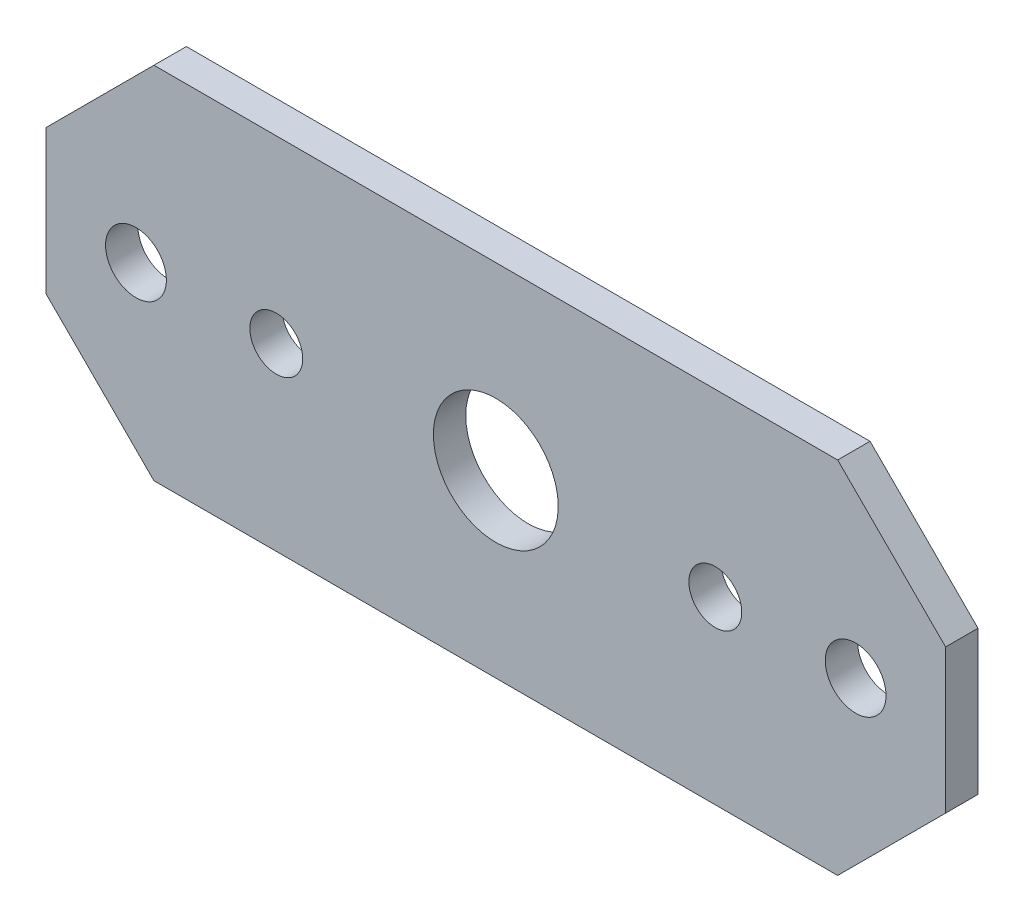
ISO-10303-21;
HEADER;
FILE_DESCRIPTION(('STEP AP214'),'2;1');
FILE_NAME('part.step','',(''),(''),'','','');
FILE_SCHEMA(('AUTOMOTIVE_DESIGN { 1 0 10303 214 1 1 1 1 }'));
ENDSEC;
DATA;
#1=APPLICATION_CONTEXT('core data for automotive mechanical design processes');
#2=APPLICATION_PROTOCOL_DEFINITION('international standard','automotive_design',2000,#1);
#3=PRODUCT_CONTEXT('',#1,'mechanical');
#4=PRODUCT('Part','Part','',(#3));
#5=PRODUCT_RELATED_PRODUCT_CATEGORY('part','',(#4));
#6=PRODUCT_DEFINITION_FORMATION('','',#4);
#7=PRODUCT_DEFINITION_CONTEXT('part definition',#1,'design');
#8=PRODUCT_DEFINITION('design','',#6,#7);
#9=PRODUCT_DEFINITION_SHAPE('','',#8);
#10=(LENGTH_UNIT() NAMED_UNIT(*) SI_UNIT(.MILLI.,.METRE.));
#11=(NAMED_UNIT(*) PLANE_ANGLE_UNIT() SI_UNIT($,.RADIAN.));
#12=(NAMED_UNIT(*) SI_UNIT($,.STERADIAN.) SOLID_ANGLE_UNIT());
#13=UNCERTAINTY_MEASURE_WITH_UNIT(LENGTH_MEASURE(1.E-05),#10,'distance_accuracy_value','');
#14=(GEOMETRIC_REPRESENTATION_CONTEXT(3) GLOBAL_UNCERTAINTY_ASSIGNED_CONTEXT((#13)) GLOBAL_UNIT_ASSIGNED_CONTEXT((#10,
#11,#12)) REPRESENTATION_CONTEXT('',''));
#15=CARTESIAN_POINT('',(0.,0.,0.));
#16=DIRECTION('',(0.,0.,1.));
#17=DIRECTION('',(1.,0.,0.));
#18=AXIS2_PLACEMENT_3D('',#15,#16,#17);
#19=CARTESIAN_POINT('',(-31.75,12.7,2.286));
#20=DIRECTION('',(0.,0.,1.));
#21=DIRECTION('',(1.,0.,0.));
#22=AXIS2_PLACEMENT_3D('',#19,#20,#21);
#23=PLANE('',#22);
#24=DIRECTION('',(1.,0.,0.));
#25=VECTOR('',#24,1.);
#26=CARTESIAN_POINT('',(-31.75,12.7,2.286));
#27=LINE('',#26,#25);
#28=CARTESIAN_POINT('',(24.13,12.7,2.286));
#29=VERTEX_POINT('',#28);
#30=CARTESIAN_POINT('',(-24.13,12.7,2.286));
#31=VERTEX_POINT('',#30);
#32=EDGE_CURVE('E342',#29,#31,#27,.F.);
#33=ORIENTED_EDGE('',*,*,#32,.T.);
#34=DIRECTION('',(0.707106781186547,0.707106781186548,0.));
#35=VECTOR('',#34,1.);
#36=CARTESIAN_POINT('',(-31.75,5.08,2.286));
#37=LINE('',#36,#35);
#38=CARTESIAN_POINT('',(-31.75,5.08,2.286));
#39=VERTEX_POINT('',#38);
#40=EDGE_CURVE('E337',#31,#39,#37,.F.);
#41=ORIENTED_EDGE('',*,*,#40,.T.);
#42=DIRECTION('',(0.,1.,0.));
#43=VECTOR('',#42,1.);
#44=CARTESIAN_POINT('',(-31.75,12.7,2.286));
#45=LINE('',#44,#43);
#46=CARTESIAN_POINT('',(-31.75,-5.08,2.286));
#47=VERTEX_POINT('',#46);
#48=EDGE_CURVE('E332',#39,#47,#45,.F.);
#49=ORIENTED_EDGE('',*,*,#48,.T.);
#50=DIRECTION('',(-0.707106781186547,0.707106781186548,0.));
#51=VECTOR('',#50,1.);
#52=CARTESIAN_POINT('',(-24.13,-12.7,2.286));
#53=LINE('',#52,#51);
#54=CARTESIAN_POINT('',(-24.13,-12.7,2.286));
#55=VERTEX_POINT('',#54);
#56=EDGE_CURVE('E327',#47,#55,#53,.F.);
#57=ORIENTED_EDGE('',*,*,#56,.T.);
#58=DIRECTION('',(-1.,0.,0.));
#59=VECTOR('',#58,1.);
#60=CARTESIAN_POINT('',(-31.75,-12.7,2.286));
#61=LINE('',#60,#59);
#62=CARTESIAN_POINT('',(24.13,-12.7,2.286));
#63=VERTEX_POINT('',#62);
#64=EDGE_CURVE('E83',#55,#63,#61,.F.);
#65=ORIENTED_EDGE('',*,*,#64,.T.);
#66=DIRECTION('',(-0.707106781186548,-0.707106781186547,0.));
#67=VECTOR('',#66,1.);
#68=CARTESIAN_POINT('',(31.75,-5.07999999999999,2.286));
#69=LINE('',#68,#67);
#70=CARTESIAN_POINT('',(31.75,-5.07999999999999,2.286));
#71=VERTEX_POINT('',#70);
#72=EDGE_CURVE('E81',#63,#71,#69,.F.);
#73=ORIENTED_EDGE('',*,*,#72,.T.);
#74=DIRECTION('',(0.,1.,0.));
#75=VECTOR('',#74,1.);
#76=CARTESIAN_POINT('',(31.75,12.7,2.286));
#77=LINE('',#76,#75);
#78=CARTESIAN_POINT('',(31.75,5.07999999999999,2.286));
#79=VERTEX_POINT('',#78);
#80=EDGE_CURVE('E78',#71,#79,#77,.T.);
#81=ORIENTED_EDGE('',*,*,#80,.T.);
#82=DIRECTION('',(0.707106781186548,-0.707106781186547,0.));
#83=VECTOR('',#82,1.);
#84=CARTESIAN_POINT('',(24.13,12.7,2.286));
#85=LINE('',#84,#83);
#86=EDGE_CURVE('E312',#79,#29,#85,.F.);
#87=ORIENTED_EDGE('',*,*,#86,.T.);
#88=EDGE_LOOP('',(#33,#41,#49,#57,#65,#73,#81,#87));
#89=FACE_BOUND('',#88,.T.);
#90=CARTESIAN_POINT('',(0.,0.,2.286));
#91=DIRECTION('',(0.,0.,-1.));
#92=DIRECTION('',(-1.,0.,0.));
#93=AXIS2_PLACEMENT_3D('',#90,#91,#92);
#94=CIRCLE('',#93,4.4069);
#95=CARTESIAN_POINT('',(-4.4069,0.,2.286));
#96=VERTEX_POINT('',#95);
#97=EDGE_CURVE('E89',#96,#96,#94,.T.);
#98=ORIENTED_EDGE('',*,*,#97,.T.);
#99=EDGE_LOOP('',(#98));
#100=FACE_BOUND('',#99,.T.);
#101=CARTESIAN_POINT('',(25.4,0.,2.286));
#102=DIRECTION('',(0.,0.,-1.));
#103=DIRECTION('',(-1.,0.,0.));
#104=AXIS2_PLACEMENT_3D('',#101,#102,#103);
#105=CIRCLE('',#104,2.1463);
#106=CARTESIAN_POINT('',(23.2537,0.,2.286));
#107=VERTEX_POINT('',#106);
#108=EDGE_CURVE('E121',#107,#107,#105,.T.);
#109=ORIENTED_EDGE('',*,*,#108,.T.);
#110=EDGE_LOOP('',(#109));
#111=FACE_BOUND('',#110,.T.);
#112=CARTESIAN_POINT('',(-25.4,0.,2.286));
#113=DIRECTION('',(0.,0.,-1.));
#114=DIRECTION('',(-1.,0.,0.));
#115=AXIS2_PLACEMENT_3D('',#112,#113,#114);
#116=CIRCLE('',#115,2.1463);
#117=CARTESIAN_POINT('',(-27.5463,0.,2.286));
#118=VERTEX_POINT('',#117);
#119=EDGE_CURVE('E124',#118,#118,#116,.T.);
#120=ORIENTED_EDGE('',*,*,#119,.T.);
#121=EDGE_LOOP('',(#120));
#122=FACE_BOUND('',#121,.T.);
#123=CARTESIAN_POINT('',(15.494,0.,2.286));
#124=DIRECTION('',(0.,0.,-1.));
#125=DIRECTION('',(-1.,0.,0.));
#126=AXIS2_PLACEMENT_3D('',#123,#124,#125);
#127=CIRCLE('',#126,1.8669);
#128=CARTESIAN_POINT('',(13.6271,0.,2.286));
#129=VERTEX_POINT('',#128);
#130=EDGE_CURVE('E126',#129,#129,#127,.T.);
#131=ORIENTED_EDGE('',*,*,#130,.T.);
#132=EDGE_LOOP('',(#131));
#133=FACE_BOUND('',#132,.T.);
#134=CARTESIAN_POINT('',(-15.494,0.,2.286));
#135=DIRECTION('',(0.,0.,-1.));
#136=DIRECTION('',(-1.,0.,0.));
#137=AXIS2_PLACEMENT_3D('',#134,#135,#136);
#138=CIRCLE('',#137,1.8669);
#139=CARTESIAN_POINT('',(-17.3609,0.,2.286));
#140=VERTEX_POINT('',#139);
#141=EDGE_CURVE('E19',#140,#140,#138,.T.);
#142=ORIENTED_EDGE('',*,*,#141,.T.);
#143=EDGE_LOOP('',(#142));
#144=FACE_BOUND('',#143,.T.);
#145=ADVANCED_FACE('F16',(#89,#100,#111,#122,#133,#144),#23,.T.);
#146=CARTESIAN_POINT('',(-15.494,0.,2.286));
#147=DIRECTION('',(0.,0.,-1.));
#148=DIRECTION('',(-1.,0.,0.));
#149=AXIS2_PLACEMENT_3D('',#146,#147,#148);
#150=CYLINDRICAL_SURFACE('',#149,1.8669);
#151=ORIENTED_EDGE('',*,*,#141,.F.);
#152=EDGE_LOOP('',(#151));
#153=FACE_BOUND('',#152,.T.);
#154=CARTESIAN_POINT('',(-15.494,0.,0.));
#155=DIRECTION('',(0.,0.,-1.));
#156=DIRECTION('',(-1.,0.,0.));
#157=AXIS2_PLACEMENT_3D('',#154,#155,#156);
#158=CIRCLE('',#157,1.8669);
#159=CARTESIAN_POINT('',(-17.3609,0.,0.));
#160=VERTEX_POINT('',#159);
#161=EDGE_CURVE('E116',#160,#160,#158,.T.);
#162=ORIENTED_EDGE('',*,*,#161,.T.);
#163=EDGE_LOOP('',(#162));
#164=FACE_BOUND('',#163,.T.);
#165=ADVANCED_FACE('F134',(#153,#164),#150,.F.);
#166=CARTESIAN_POINT('',(15.494,0.,2.286));
#167=DIRECTION('',(0.,0.,-1.));
#168=DIRECTION('',(-1.,0.,0.));
#169=AXIS2_PLACEMENT_3D('',#166,#167,#168);
#170=CYLINDRICAL_SURFACE('',#169,1.8669);
#171=ORIENTED_EDGE('',*,*,#130,.F.);
#172=EDGE_LOOP('',(#171));
#173=FACE_BOUND('',#172,.T.);
#174=CARTESIAN_POINT('',(15.494,0.,0.));
#175=DIRECTION('',(0.,0.,-1.));
#176=DIRECTION('',(-1.,0.,0.));
#177=AXIS2_PLACEMENT_3D('',#174,#175,#176);
#178=CIRCLE('',#177,1.8669);
#179=CARTESIAN_POINT('',(13.6271,0.,0.));
#180=VERTEX_POINT('',#179);
#181=EDGE_CURVE('E113',#180,#180,#178,.T.);
#182=ORIENTED_EDGE('',*,*,#181,.T.);
#183=EDGE_LOOP('',(#182));
#184=FACE_BOUND('',#183,.T.);
#185=ADVANCED_FACE('F137',(#173,#184),#170,.F.);
#186=CARTESIAN_POINT('',(-25.4,0.,2.286));
#187=DIRECTION('',(0.,0.,-1.));
#188=DIRECTION('',(-1.,0.,0.));
#189=AXIS2_PLACEMENT_3D('',#186,#187,#188);
#190=CYLINDRICAL_SURFACE('',#189,2.1463);
#191=ORIENTED_EDGE('',*,*,#119,.F.);
#192=EDGE_LOOP('',(#191));
#193=FACE_BOUND('',#192,.T.);
#194=CARTESIAN_POINT('',(-25.4,0.,0.));
#195=DIRECTION('',(0.,0.,-1.));
#196=DIRECTION('',(-1.,0.,0.));
#197=AXIS2_PLACEMENT_3D('',#194,#195,#196);
#198=CIRCLE('',#197,2.1463);
#199=CARTESIAN_POINT('',(-27.5463,0.,0.));
#200=VERTEX_POINT('',#199);
#201=EDGE_CURVE('E110',#200,#200,#198,.T.);
#202=ORIENTED_EDGE('',*,*,#201,.T.);
#203=EDGE_LOOP('',(#202));
#204=FACE_BOUND('',#203,.T.);
#205=ADVANCED_FACE('F184',(#193,#204),#190,.F.);
#206=CARTESIAN_POINT('',(25.4,0.,2.286));
#207=DIRECTION('',(0.,0.,-1.));
#208=DIRECTION('',(-1.,0.,0.));
#209=AXIS2_PLACEMENT_3D('',#206,#207,#208);
#210=CYLINDRICAL_SURFACE('',#209,2.1463);
#211=ORIENTED_EDGE('',*,*,#108,.F.);
#212=EDGE_LOOP('',(#211));
#213=FACE_BOUND('',#212,.T.);
#214=CARTESIAN_POINT('',(25.4,0.,0.));
#215=DIRECTION('',(0.,0.,-1.));
#216=DIRECTION('',(-1.,0.,0.));
#217=AXIS2_PLACEMENT_3D('',#214,#215,#216);
#218=CIRCLE('',#217,2.1463);
#219=CARTESIAN_POINT('',(23.2537,0.,0.));
#220=VERTEX_POINT('',#219);
#221=EDGE_CURVE('E107',#220,#220,#218,.T.);
#222=ORIENTED_EDGE('',*,*,#221,.T.);
#223=EDGE_LOOP('',(#222));
#224=FACE_BOUND('',#223,.T.);
#225=ADVANCED_FACE('F180',(#213,#224),#210,.F.);
#226=CARTESIAN_POINT('',(0.,0.,2.286));
#227=DIRECTION('',(0.,0.,-1.));
#228=DIRECTION('',(-1.,0.,0.));
#229=AXIS2_PLACEMENT_3D('',#226,#227,#228);
#230=CYLINDRICAL_SURFACE('',#229,4.4069);
#231=ORIENTED_EDGE('',*,*,#97,.F.);
#232=EDGE_LOOP('',(#231));
#233=FACE_BOUND('',#232,.T.);
#234=CARTESIAN_POINT('',(0.,0.,0.));
#235=DIRECTION('',(0.,0.,-1.));
#236=DIRECTION('',(-1.,0.,0.));
#237=AXIS2_PLACEMENT_3D('',#234,#235,#236);
#238=CIRCLE('',#237,4.4069);
#239=CARTESIAN_POINT('',(-4.4069,0.,0.));
#240=VERTEX_POINT('',#239);
#241=EDGE_CURVE('E104',#240,#240,#238,.T.);
#242=ORIENTED_EDGE('',*,*,#241,.T.);
#243=EDGE_LOOP('',(#242));
#244=FACE_BOUND('',#243,.T.);
#245=ADVANCED_FACE('F177',(#233,#244),#230,.F.);
#246=CARTESIAN_POINT('',(31.75,-5.07999999999999,2.286));
#247=DIRECTION('',(-0.707106781186547,0.707106781186548,0.));
#248=DIRECTION('',(-0.707106781186548,-0.707106781186547,0.));
#249=AXIS2_PLACEMENT_3D('',#246,#247,#248);
#250=PLANE('',#249);
#251=DIRECTION('',(0.,0.,1.));
#252=VECTOR('',#251,1.);
#253=CARTESIAN_POINT('',(24.13,-12.7,2.286));
#254=LINE('',#253,#252);
#255=CARTESIAN_POINT('',(24.13,-12.7,0.));
#256=VERTEX_POINT('',#255);
#257=EDGE_CURVE('E325',#63,#256,#254,.F.);
#258=ORIENTED_EDGE('',*,*,#257,.T.);
#259=DIRECTION('',(0.707106781186548,0.707106781186547,0.));
#260=VECTOR('',#259,1.);
#261=CARTESIAN_POINT('',(24.13,-12.7,0.));
#262=LINE('',#261,#260);
#263=CARTESIAN_POINT('',(31.75,-5.07999999999999,0.));
#264=VERTEX_POINT('',#263);
#265=EDGE_CURVE('E100',#256,#264,#262,.T.);
#266=ORIENTED_EDGE('',*,*,#265,.T.);
#267=DIRECTION('',(0.,0.,1.));
#268=VECTOR('',#267,1.);
#269=CARTESIAN_POINT('',(31.75,-5.07999999999999,2.286));
#270=LINE('',#269,#268);
#271=EDGE_CURVE('E88',#264,#71,#270,.T.);
#272=ORIENTED_EDGE('',*,*,#271,.T.);
#273=ORIENTED_EDGE('',*,*,#72,.F.);
#274=EDGE_LOOP('',(#258,#266,#272,#273));
#275=FACE_BOUND('',#274,.T.);
#276=ADVANCED_FACE('F99',(#275),#250,.F.);
#277=CARTESIAN_POINT('',(31.75,12.7,2.286));
#278=DIRECTION('',(-1.,0.,0.));
#279=DIRECTION('',(0.,0.,1.));
#280=AXIS2_PLACEMENT_3D('',#277,#278,#279);
#281=PLANE('',#280);
#282=ORIENTED_EDGE('',*,*,#271,.F.);
#283=DIRECTION('',(0.,1.,0.));
#284=VECTOR('',#283,1.);
#285=CARTESIAN_POINT('',(31.75,12.7,0.));
#286=LINE('',#285,#284);
#287=CARTESIAN_POINT('',(31.75,5.08,0.));
#288=VERTEX_POINT('',#287);
#289=EDGE_CURVE('E314',#264,#288,#286,.T.);
#290=ORIENTED_EDGE('',*,*,#289,.T.);
#291=DIRECTION('',(0.,0.,1.));
#292=VECTOR('',#291,1.);
#293=CARTESIAN_POINT('',(31.75,5.08,2.286));
#294=LINE('',#293,#292);
#295=EDGE_CURVE('E96',#288,#79,#294,.T.);
#296=ORIENTED_EDGE('',*,*,#295,.T.);
#297=ORIENTED_EDGE('',*,*,#80,.F.);
#298=EDGE_LOOP('',(#282,#290,#296,#297));
#299=FACE_BOUND('',#298,.T.);
#300=ADVANCED_FACE('F93',(#299),#281,.F.);
#301=CARTESIAN_POINT('',(24.13,12.7,2.286));
#302=DIRECTION('',(-0.707106781186547,-0.707106781186548,0.));
#303=DIRECTION('',(0.707106781186548,-0.707106781186547,0.));
#304=AXIS2_PLACEMENT_3D('',#301,#302,#303);
#305=PLANE('',#304);
#306=ORIENTED_EDGE('',*,*,#295,.F.);
#307=DIRECTION('',(-0.707106781186548,0.707106781186547,0.));
#308=VECTOR('',#307,1.);
#309=CARTESIAN_POINT('',(31.75,5.08,0.));
#310=LINE('',#309,#308);
#311=CARTESIAN_POINT('',(24.13,12.7,0.));
#312=VERTEX_POINT('',#311);
#313=EDGE_CURVE('E311',#288,#312,#310,.T.);
#314=ORIENTED_EDGE('',*,*,#313,.T.);
#315=DIRECTION('',(0.,0.,-1.));
#316=VECTOR('',#315,1.);
#317=CARTESIAN_POINT('',(24.13,12.7,2.286));
#318=LINE('',#317,#316);
#319=EDGE_CURVE('E344',#312,#29,#318,.F.);
#320=ORIENTED_EDGE('',*,*,#319,.T.);
#321=ORIENTED_EDGE('',*,*,#86,.F.);
#322=EDGE_LOOP('',(#306,#314,#320,#321));
#323=FACE_BOUND('',#322,.T.);
#324=ADVANCED_FACE('F168',(#323),#305,.F.);
#325=CARTESIAN_POINT('',(-31.75,12.7,2.286));
#326=DIRECTION('',(0.,-1.,0.));
#327=DIRECTION('',(0.,0.,-1.));
#328=AXIS2_PLACEMENT_3D('',#325,#326,#327);
#329=PLANE('',#328);
#330=ORIENTED_EDGE('',*,*,#319,.F.);
#331=DIRECTION('',(1.,0.,0.));
#332=VECTOR('',#331,1.);
#333=CARTESIAN_POINT('',(-31.75,12.7,0.));
#334=LINE('',#333,#332);
#335=CARTESIAN_POINT('',(-24.13,12.7,0.));
#336=VERTEX_POINT('',#335);
#337=EDGE_CURVE('E317',#312,#336,#334,.F.);
#338=ORIENTED_EDGE('',*,*,#337,.T.);
#339=DIRECTION('',(0.,0.,1.));
#340=VECTOR('',#339,1.);
#341=CARTESIAN_POINT('',(-24.13,12.7,2.286));
#342=LINE('',#341,#340);
#343=EDGE_CURVE('E339',#336,#31,#342,.T.);
#344=ORIENTED_EDGE('',*,*,#343,.T.);
#345=ORIENTED_EDGE('',*,*,#32,.F.);
#346=EDGE_LOOP('',(#330,#338,#344,#345));
#347=FACE_BOUND('',#346,.T.);
#348=ADVANCED_FACE('F164',(#347),#329,.F.);
#349=CARTESIAN_POINT('',(-31.75,5.08,2.286));
#350=DIRECTION('',(0.707106781186548,-0.707106781186547,0.));
#351=DIRECTION('',(0.707106781186547,0.707106781186548,0.));
#352=AXIS2_PLACEMENT_3D('',#349,#350,#351);
#353=PLANE('',#352);
#354=ORIENTED_EDGE('',*,*,#343,.F.);
#355=DIRECTION('',(-0.707106781186547,-0.707106781186548,0.));
#356=VECTOR('',#355,1.);
#357=CARTESIAN_POINT('',(-24.13,12.7,0.));
#358=LINE('',#357,#356);
#359=CARTESIAN_POINT('',(-31.75,5.08,0.));
#360=VERTEX_POINT('',#359);
#361=EDGE_CURVE('E349',#336,#360,#358,.T.);
#362=ORIENTED_EDGE('',*,*,#361,.T.);
#363=DIRECTION('',(0.,0.,-1.));
#364=VECTOR('',#363,1.);
#365=CARTESIAN_POINT('',(-31.75,5.08,2.286));
#366=LINE('',#365,#364);
#367=EDGE_CURVE('E334',#360,#39,#366,.F.);
#368=ORIENTED_EDGE('',*,*,#367,.T.);
#369=ORIENTED_EDGE('',*,*,#40,.F.);
#370=EDGE_LOOP('',(#354,#362,#368,#369));
#371=FACE_BOUND('',#370,.T.);
#372=ADVANCED_FACE('F160',(#371),#353,.F.);
#373=CARTESIAN_POINT('',(-31.75,12.7,2.286));
#374=DIRECTION('',(1.,0.,0.));
#375=DIRECTION('',(0.,0.,-1.));
#376=AXIS2_PLACEMENT_3D('',#373,#374,#375);
#377=PLANE('',#376);
#378=DIRECTION('',(0.,0.,1.));
#379=VECTOR('',#378,1.);
#380=CARTESIAN_POINT('',(-31.75,-5.08,2.286));
#381=LINE('',#380,#379);
#382=CARTESIAN_POINT('',(-31.75,-5.08,0.));
#383=VERTEX_POINT('',#382);
#384=EDGE_CURVE('E329',#383,#47,#381,.T.);
#385=ORIENTED_EDGE('',*,*,#384,.T.);
#386=ORIENTED_EDGE('',*,*,#48,.F.);
#387=ORIENTED_EDGE('',*,*,#367,.F.);
#388=DIRECTION('',(0.,1.,0.));
#389=VECTOR('',#388,1.);
#390=CARTESIAN_POINT('',(-31.75,12.7,0.));
#391=LINE('',#390,#389);
#392=EDGE_CURVE('E352',#360,#383,#391,.F.);
#393=ORIENTED_EDGE('',*,*,#392,.T.);
#394=EDGE_LOOP('',(#385,#386,#387,#393));
#395=FACE_BOUND('',#394,.T.);
#396=ADVANCED_FACE('F156',(#395),#377,.F.);
#397=CARTESIAN_POINT('',(-24.13,-12.7,2.286));
#398=DIRECTION('',(0.707106781186548,0.707106781186547,0.));
#399=DIRECTION('',(-0.707106781186547,0.707106781186548,0.));
#400=AXIS2_PLACEMENT_3D('',#397,#398,#399);
#401=PLANE('',#400);
#402=ORIENTED_EDGE('',*,*,#384,.F.);
#403=DIRECTION('',(0.707106781186547,-0.707106781186548,0.));
#404=VECTOR('',#403,1.);
#405=CARTESIAN_POINT('',(-31.75,-5.08,0.));
#406=LINE('',#405,#404);
#407=CARTESIAN_POINT('',(-24.13,-12.7,0.));
#408=VERTEX_POINT('',#407);
#409=EDGE_CURVE('E25',#383,#408,#406,.T.);
#410=ORIENTED_EDGE('',*,*,#409,.T.);
#411=DIRECTION('',(0.,0.,1.));
#412=VECTOR('',#411,1.);
#413=CARTESIAN_POINT('',(-24.13,-12.7,2.286));
#414=LINE('',#413,#412);
#415=EDGE_CURVE('E33',#408,#55,#414,.T.);
#416=ORIENTED_EDGE('',*,*,#415,.T.);
#417=ORIENTED_EDGE('',*,*,#56,.F.);
#418=EDGE_LOOP('',(#402,#410,#416,#417));
#419=FACE_BOUND('',#418,.T.);
#420=ADVANCED_FACE('F149',(#419),#401,.F.);
#421=CARTESIAN_POINT('',(-31.75,-12.7,2.286));
#422=DIRECTION('',(0.,1.,0.));
#423=DIRECTION('',(-1.,0.,0.));
#424=AXIS2_PLACEMENT_3D('',#421,#422,#423);
#425=PLANE('',#424);
#426=ORIENTED_EDGE('',*,*,#415,.F.);
#427=DIRECTION('',(1.,0.,0.));
#428=VECTOR('',#427,1.);
#429=CARTESIAN_POINT('',(-31.75,-12.7,0.));
#430=LINE('',#429,#428);
#431=EDGE_CURVE('E11',#408,#256,#430,.T.);
#432=ORIENTED_EDGE('',*,*,#431,.T.);
#433=ORIENTED_EDGE('',*,*,#257,.F.);
#434=ORIENTED_EDGE('',*,*,#64,.F.);
#435=EDGE_LOOP('',(#426,#432,#433,#434));
#436=FACE_BOUND('',#435,.T.);
#437=ADVANCED_FACE('F142',(#436),#425,.F.);
#438=CARTESIAN_POINT('',(-31.75,12.7,0.));
#439=DIRECTION('',(0.,0.,1.));
#440=DIRECTION('',(1.,0.,0.));
#441=AXIS2_PLACEMENT_3D('',#438,#439,#440);
#442=PLANE('',#441);
#443=ORIENTED_EDGE('',*,*,#409,.F.);
#444=ORIENTED_EDGE('',*,*,#392,.F.);
#445=ORIENTED_EDGE('',*,*,#361,.F.);
#446=ORIENTED_EDGE('',*,*,#337,.F.);
#447=ORIENTED_EDGE('',*,*,#313,.F.);
#448=ORIENTED_EDGE('',*,*,#289,.F.);
#449=ORIENTED_EDGE('',*,*,#265,.F.);
#450=ORIENTED_EDGE('',*,*,#431,.F.);
#451=EDGE_LOOP('',(#443,#444,#445,#446,#447,#448,#449,#450));
#452=FACE_BOUND('',#451,.T.);
#453=ORIENTED_EDGE('',*,*,#241,.F.);
#454=EDGE_LOOP('',(#453));
#455=FACE_BOUND('',#454,.T.);
#456=ORIENTED_EDGE('',*,*,#221,.F.);
#457=EDGE_LOOP('',(#456));
#458=FACE_BOUND('',#457,.T.);
#459=ORIENTED_EDGE('',*,*,#201,.F.);
#460=EDGE_LOOP('',(#459));
#461=FACE_BOUND('',#460,.T.);
#462=ORIENTED_EDGE('',*,*,#181,.F.);
#463=EDGE_LOOP('',(#462));
#464=FACE_BOUND('',#463,.T.);
#465=ORIENTED_EDGE('',*,*,#161,.F.);
#466=EDGE_LOOP('',(#465));
#467=FACE_BOUND('',#466,.T.);
#468=ADVANCED_FACE('F140',(#452,#455,#458,#461,#464,#467),#442,.F.);
#469=CLOSED_SHELL('',(#145,#165,#185,#205,#225,#245,#276,#300,#324,#348,#372,#396,#420,#437,#468));
#470=MANIFOLD_SOLID_BREP('B1',#469);
#471=ADVANCED_BREP_SHAPE_REPRESENTATION('',(#18,#470),#14);
#472=SHAPE_DEFINITION_REPRESENTATION(#9,#471);
ENDSEC;
END-ISO-10303-21;
